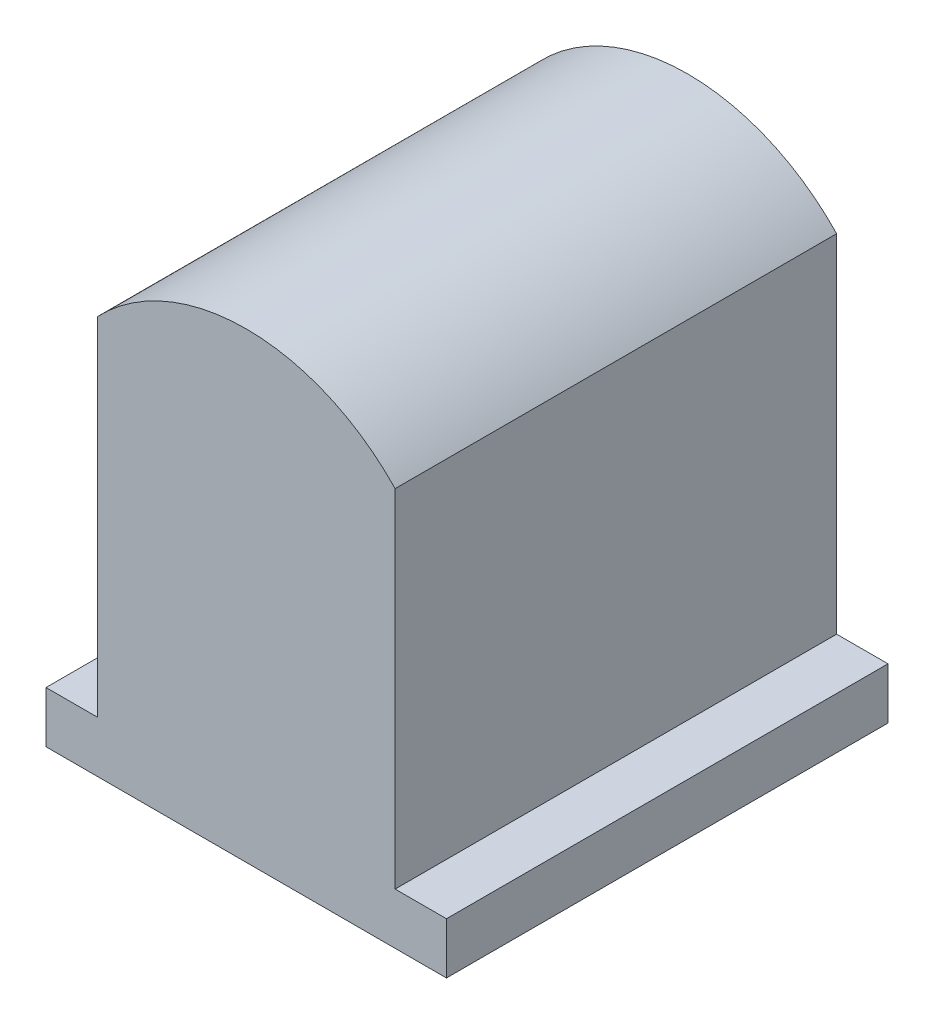
ISO-10303-21;
HEADER;
FILE_DESCRIPTION(('STEP AP214'),'2;1');
FILE_NAME('part.step','',(''),(''),'','','');
FILE_SCHEMA(('AUTOMOTIVE_DESIGN { 1 0 10303 214 1 1 1 1 }'));
ENDSEC;
DATA;
#1=APPLICATION_CONTEXT('core data for automotive mechanical design processes');
#2=APPLICATION_PROTOCOL_DEFINITION('international standard','automotive_design',2000,#1);
#3=PRODUCT_CONTEXT('',#1,'mechanical');
#4=PRODUCT('Part','Part','',(#3));
#5=PRODUCT_RELATED_PRODUCT_CATEGORY('part','',(#4));
#6=PRODUCT_DEFINITION_FORMATION('','',#4);
#7=PRODUCT_DEFINITION_CONTEXT('part definition',#1,'design');
#8=PRODUCT_DEFINITION('design','',#6,#7);
#9=PRODUCT_DEFINITION_SHAPE('','',#8);
#10=(LENGTH_UNIT() NAMED_UNIT(*) SI_UNIT(.MILLI.,.METRE.));
#11=(NAMED_UNIT(*) PLANE_ANGLE_UNIT() SI_UNIT($,.RADIAN.));
#12=(NAMED_UNIT(*) SI_UNIT($,.STERADIAN.) SOLID_ANGLE_UNIT());
#13=UNCERTAINTY_MEASURE_WITH_UNIT(LENGTH_MEASURE(1.E-05),#10,'distance_accuracy_value','');
#14=(GEOMETRIC_REPRESENTATION_CONTEXT(3) GLOBAL_UNCERTAINTY_ASSIGNED_CONTEXT((#13)) GLOBAL_UNIT_ASSIGNED_CONTEXT((#10,
#11,#12)) REPRESENTATION_CONTEXT('',''));
#15=CARTESIAN_POINT('',(0.,0.,0.));
#16=DIRECTION('',(0.,0.,1.));
#17=DIRECTION('',(1.,0.,0.));
#18=AXIS2_PLACEMENT_3D('',#15,#16,#17);
#19=CARTESIAN_POINT('',(0.,0.561251134302204,4.3));
#20=DIRECTION('',(0.,0.,-1.));
#21=DIRECTION('',(-1.,0.,0.));
#22=AXIS2_PLACEMENT_3D('',#19,#20,#21);
#23=CYLINDRICAL_SURFACE('',#22,2.);
#24=CARTESIAN_POINT('',(0.,0.561251134302204,0.));
#25=DIRECTION('',(0.,0.,1.));
#26=DIRECTION('',(-1.,0.,0.));
#27=AXIS2_PLACEMENT_3D('',#24,#25,#26);
#28=CIRCLE('',#27,2.);
#29=CARTESIAN_POINT('',(1.45,1.9387488656978,0.));
#30=VERTEX_POINT('',#29);
#31=CARTESIAN_POINT('',(-1.45,1.9387488656978,0.));
#32=VERTEX_POINT('',#31);
#33=EDGE_CURVE('E133',#30,#32,#28,.T.);
#34=ORIENTED_EDGE('',*,*,#33,.T.);
#35=DIRECTION('',(0.,0.,-1.));
#36=VECTOR('',#35,1.);
#37=CARTESIAN_POINT('',(-1.45,1.9387488656978,4.3));
#38=LINE('',#37,#36);
#39=CARTESIAN_POINT('',(-1.45,1.9387488656978,4.3));
#40=VERTEX_POINT('',#39);
#41=EDGE_CURVE('E11',#40,#32,#38,.T.);
#42=ORIENTED_EDGE('',*,*,#41,.F.);
#43=CARTESIAN_POINT('',(0.,0.561251134302204,4.3));
#44=DIRECTION('',(0.,0.,1.));
#45=DIRECTION('',(-1.,0.,0.));
#46=AXIS2_PLACEMENT_3D('',#43,#44,#45);
#47=CIRCLE('',#46,2.);
#48=CARTESIAN_POINT('',(1.45,1.9387488656978,4.3));
#49=VERTEX_POINT('',#48);
#50=EDGE_CURVE('E148',#49,#40,#47,.T.);
#51=ORIENTED_EDGE('',*,*,#50,.F.);
#52=DIRECTION('',(0.,0.,-1.));
#53=VECTOR('',#52,1.);
#54=CARTESIAN_POINT('',(1.45,1.9387488656978,4.3));
#55=LINE('',#54,#53);
#56=EDGE_CURVE('E129',#49,#30,#55,.T.);
#57=ORIENTED_EDGE('',*,*,#56,.T.);
#58=EDGE_LOOP('',(#34,#42,#51,#57));
#59=FACE_BOUND('',#58,.T.);
#60=ADVANCED_FACE('F37',(#59),#23,.T.);
#61=CARTESIAN_POINT('',(-1.45,-1.4387488656978,4.3));
#62=DIRECTION('',(1.,0.,0.));
#63=DIRECTION('',(0.,0.,-1.));
#64=AXIS2_PLACEMENT_3D('',#61,#62,#63);
#65=PLANE('',#64);
#66=DIRECTION('',(0.,-1.,0.));
#67=VECTOR('',#66,1.);
#68=CARTESIAN_POINT('',(-1.45,-1.4387488656978,0.));
#69=LINE('',#68,#67);
#70=CARTESIAN_POINT('',(-1.45,-1.4387488656978,0.));
#71=VERTEX_POINT('',#70);
#72=EDGE_CURVE('E136',#32,#71,#69,.T.);
#73=ORIENTED_EDGE('',*,*,#72,.T.);
#74=DIRECTION('',(0.,0.,-1.));
#75=VECTOR('',#74,1.);
#76=CARTESIAN_POINT('',(-1.45,-1.4387488656978,4.3));
#77=LINE('',#76,#75);
#78=CARTESIAN_POINT('',(-1.45,-1.4387488656978,4.3));
#79=VERTEX_POINT('',#78);
#80=EDGE_CURVE('E45',#79,#71,#77,.T.);
#81=ORIENTED_EDGE('',*,*,#80,.F.);
#82=DIRECTION('',(0.,-1.,0.));
#83=VECTOR('',#82,1.);
#84=CARTESIAN_POINT('',(-1.45,-1.4387488656978,4.3));
#85=LINE('',#84,#83);
#86=EDGE_CURVE('E96',#40,#79,#85,.T.);
#87=ORIENTED_EDGE('',*,*,#86,.F.);
#88=ORIENTED_EDGE('',*,*,#41,.T.);
#89=EDGE_LOOP('',(#73,#81,#87,#88));
#90=FACE_BOUND('',#89,.T.);
#91=ADVANCED_FACE('F182',(#90),#65,.F.);
#92=CARTESIAN_POINT('',(-1.45,-1.4387488656978,4.3));
#93=DIRECTION('',(0.,-1.,0.));
#94=DIRECTION('',(0.,0.,-1.));
#95=AXIS2_PLACEMENT_3D('',#92,#93,#94);
#96=PLANE('',#95);
#97=DIRECTION('',(-1.,0.,0.));
#98=VECTOR('',#97,1.);
#99=CARTESIAN_POINT('',(-1.45,-1.4387488656978,0.));
#100=LINE('',#99,#98);
#101=CARTESIAN_POINT('',(-1.95,-1.4387488656978,0.));
#102=VERTEX_POINT('',#101);
#103=EDGE_CURVE('E138',#71,#102,#100,.T.);
#104=ORIENTED_EDGE('',*,*,#103,.T.);
#105=DIRECTION('',(0.,0.,-1.));
#106=VECTOR('',#105,1.);
#107=CARTESIAN_POINT('',(-1.95,-1.4387488656978,4.3));
#108=LINE('',#107,#106);
#109=CARTESIAN_POINT('',(-1.95,-1.4387488656978,4.3));
#110=VERTEX_POINT('',#109);
#111=EDGE_CURVE('E155',#110,#102,#108,.T.);
#112=ORIENTED_EDGE('',*,*,#111,.F.);
#113=DIRECTION('',(-1.,0.,0.));
#114=VECTOR('',#113,1.);
#115=CARTESIAN_POINT('',(-1.45,-1.4387488656978,4.3));
#116=LINE('',#115,#114);
#117=EDGE_CURVE('E163',#79,#110,#116,.T.);
#118=ORIENTED_EDGE('',*,*,#117,.F.);
#119=ORIENTED_EDGE('',*,*,#80,.T.);
#120=EDGE_LOOP('',(#104,#112,#118,#119));
#121=FACE_BOUND('',#120,.T.);
#122=ADVANCED_FACE('F161',(#121),#96,.F.);
#123=CARTESIAN_POINT('',(-1.95,-1.4387488656978,4.3));
#124=DIRECTION('',(1.,0.,0.));
#125=DIRECTION('',(0.,0.,-1.));
#126=AXIS2_PLACEMENT_3D('',#123,#124,#125);
#127=PLANE('',#126);
#128=DIRECTION('',(0.,-1.,0.));
#129=VECTOR('',#128,1.);
#130=CARTESIAN_POINT('',(-1.95,-1.4387488656978,0.));
#131=LINE('',#130,#129);
#132=CARTESIAN_POINT('',(-1.95,-1.9387488656978,0.));
#133=VERTEX_POINT('',#132);
#134=EDGE_CURVE('E140',#102,#133,#131,.T.);
#135=ORIENTED_EDGE('',*,*,#134,.T.);
#136=DIRECTION('',(0.,0.,-1.));
#137=VECTOR('',#136,1.);
#138=CARTESIAN_POINT('',(-1.95,-1.9387488656978,4.3));
#139=LINE('',#138,#137);
#140=CARTESIAN_POINT('',(-1.95,-1.9387488656978,4.3));
#141=VERTEX_POINT('',#140);
#142=EDGE_CURVE('E152',#141,#133,#139,.T.);
#143=ORIENTED_EDGE('',*,*,#142,.F.);
#144=DIRECTION('',(0.,-1.,0.));
#145=VECTOR('',#144,1.);
#146=CARTESIAN_POINT('',(-1.95,-1.4387488656978,4.3));
#147=LINE('',#146,#145);
#148=EDGE_CURVE('E174',#110,#141,#147,.T.);
#149=ORIENTED_EDGE('',*,*,#148,.F.);
#150=ORIENTED_EDGE('',*,*,#111,.T.);
#151=EDGE_LOOP('',(#135,#143,#149,#150));
#152=FACE_BOUND('',#151,.T.);
#153=ADVANCED_FACE('F170',(#152),#127,.F.);
#154=CARTESIAN_POINT('',(1.95,-1.9387488656978,4.3));
#155=DIRECTION('',(0.,1.,0.));
#156=DIRECTION('',(0.,0.,1.));
#157=AXIS2_PLACEMENT_3D('',#154,#155,#156);
#158=PLANE('',#157);
#159=DIRECTION('',(1.,0.,0.));
#160=VECTOR('',#159,1.);
#161=CARTESIAN_POINT('',(1.95,-1.9387488656978,0.));
#162=LINE('',#161,#160);
#163=CARTESIAN_POINT('',(1.95,-1.9387488656978,0.));
#164=VERTEX_POINT('',#163);
#165=EDGE_CURVE('E143',#133,#164,#162,.T.);
#166=ORIENTED_EDGE('',*,*,#165,.T.);
#167=DIRECTION('',(0.,0.,-1.));
#168=VECTOR('',#167,1.);
#169=CARTESIAN_POINT('',(1.95,-1.9387488656978,4.3));
#170=LINE('',#169,#168);
#171=CARTESIAN_POINT('',(1.95,-1.9387488656978,4.3));
#172=VERTEX_POINT('',#171);
#173=EDGE_CURVE('E124',#172,#164,#170,.T.);
#174=ORIENTED_EDGE('',*,*,#173,.F.);
#175=DIRECTION('',(1.,0.,0.));
#176=VECTOR('',#175,1.);
#177=CARTESIAN_POINT('',(-1.95,-1.9387488656978,4.3));
#178=LINE('',#177,#176);
#179=EDGE_CURVE('E115',#141,#172,#178,.T.);
#180=ORIENTED_EDGE('',*,*,#179,.F.);
#181=ORIENTED_EDGE('',*,*,#142,.T.);
#182=EDGE_LOOP('',(#166,#174,#180,#181));
#183=FACE_BOUND('',#182,.T.);
#184=ADVANCED_FACE('F173',(#183),#158,.F.);
#185=CARTESIAN_POINT('',(1.95,-1.43874886569779,4.3));
#186=DIRECTION('',(-1.,0.,0.));
#187=DIRECTION('',(0.,0.,1.));
#188=AXIS2_PLACEMENT_3D('',#185,#186,#187);
#189=PLANE('',#188);
#190=DIRECTION('',(0.,1.,0.));
#191=VECTOR('',#190,1.);
#192=CARTESIAN_POINT('',(1.95,-1.43874886569779,0.));
#193=LINE('',#192,#191);
#194=CARTESIAN_POINT('',(1.95,-1.43874886569779,0.));
#195=VERTEX_POINT('',#194);
#196=EDGE_CURVE('E123',#164,#195,#193,.T.);
#197=ORIENTED_EDGE('',*,*,#196,.T.);
#198=DIRECTION('',(0.,0.,-1.));
#199=VECTOR('',#198,1.);
#200=CARTESIAN_POINT('',(1.95,-1.43874886569779,4.3));
#201=LINE('',#200,#199);
#202=CARTESIAN_POINT('',(1.95,-1.43874886569779,4.3));
#203=VERTEX_POINT('',#202);
#204=EDGE_CURVE('E120',#203,#195,#201,.T.);
#205=ORIENTED_EDGE('',*,*,#204,.F.);
#206=DIRECTION('',(0.,1.,0.));
#207=VECTOR('',#206,1.);
#208=CARTESIAN_POINT('',(1.95,-1.43874886569779,4.3));
#209=LINE('',#208,#207);
#210=EDGE_CURVE('E109',#172,#203,#209,.T.);
#211=ORIENTED_EDGE('',*,*,#210,.F.);
#212=ORIENTED_EDGE('',*,*,#173,.T.);
#213=EDGE_LOOP('',(#197,#205,#211,#212));
#214=FACE_BOUND('',#213,.T.);
#215=ADVANCED_FACE('F121',(#214),#189,.F.);
#216=CARTESIAN_POINT('',(1.45,-1.4387488656978,4.3));
#217=DIRECTION('',(0.,-1.,0.));
#218=DIRECTION('',(1.,0.,0.));
#219=AXIS2_PLACEMENT_3D('',#216,#217,#218);
#220=PLANE('',#219);
#221=DIRECTION('',(-1.,0.,0.));
#222=VECTOR('',#221,1.);
#223=CARTESIAN_POINT('',(1.45,-1.4387488656978,0.));
#224=LINE('',#223,#222);
#225=CARTESIAN_POINT('',(1.45,-1.4387488656978,0.));
#226=VERTEX_POINT('',#225);
#227=EDGE_CURVE('E82',#195,#226,#224,.T.);
#228=ORIENTED_EDGE('',*,*,#227,.T.);
#229=DIRECTION('',(0.,0.,-1.));
#230=VECTOR('',#229,1.);
#231=CARTESIAN_POINT('',(1.45,-1.4387488656978,4.3));
#232=LINE('',#231,#230);
#233=CARTESIAN_POINT('',(1.45,-1.4387488656978,4.3));
#234=VERTEX_POINT('',#233);
#235=EDGE_CURVE('E125',#234,#226,#232,.T.);
#236=ORIENTED_EDGE('',*,*,#235,.F.);
#237=DIRECTION('',(-1.,0.,0.));
#238=VECTOR('',#237,1.);
#239=CARTESIAN_POINT('',(1.45,-1.4387488656978,4.3));
#240=LINE('',#239,#238);
#241=EDGE_CURVE('E113',#203,#234,#240,.T.);
#242=ORIENTED_EDGE('',*,*,#241,.F.);
#243=ORIENTED_EDGE('',*,*,#204,.T.);
#244=EDGE_LOOP('',(#228,#236,#242,#243));
#245=FACE_BOUND('',#244,.T.);
#246=ADVANCED_FACE('F127',(#245),#220,.F.);
#247=CARTESIAN_POINT('',(1.45,-1.4387488656978,4.3));
#248=DIRECTION('',(-1.,0.,0.));
#249=DIRECTION('',(0.,0.,1.));
#250=AXIS2_PLACEMENT_3D('',#247,#248,#249);
#251=PLANE('',#250);
#252=DIRECTION('',(0.,1.,0.));
#253=VECTOR('',#252,1.);
#254=CARTESIAN_POINT('',(1.45,-1.4387488656978,0.));
#255=LINE('',#254,#253);
#256=EDGE_CURVE('E88',#226,#30,#255,.T.);
#257=ORIENTED_EDGE('',*,*,#256,.T.);
#258=ORIENTED_EDGE('',*,*,#56,.F.);
#259=DIRECTION('',(0.,1.,0.));
#260=VECTOR('',#259,1.);
#261=CARTESIAN_POINT('',(1.45,-1.4387488656978,4.3));
#262=LINE('',#261,#260);
#263=EDGE_CURVE('E53',#234,#49,#262,.T.);
#264=ORIENTED_EDGE('',*,*,#263,.F.);
#265=ORIENTED_EDGE('',*,*,#235,.T.);
#266=EDGE_LOOP('',(#257,#258,#264,#265));
#267=FACE_BOUND('',#266,.T.);
#268=ADVANCED_FACE('F198',(#267),#251,.F.);
#269=CARTESIAN_POINT('',(0.,0.561251134302204,4.3));
#270=DIRECTION('',(0.,0.,-1.));
#271=DIRECTION('',(-1.,0.,0.));
#272=AXIS2_PLACEMENT_3D('',#269,#270,#271);
#273=PLANE('',#272);
#274=ORIENTED_EDGE('',*,*,#50,.T.);
#275=ORIENTED_EDGE('',*,*,#86,.T.);
#276=ORIENTED_EDGE('',*,*,#117,.T.);
#277=ORIENTED_EDGE('',*,*,#148,.T.);
#278=ORIENTED_EDGE('',*,*,#179,.T.);
#279=ORIENTED_EDGE('',*,*,#210,.T.);
#280=ORIENTED_EDGE('',*,*,#241,.T.);
#281=ORIENTED_EDGE('',*,*,#263,.T.);
#282=EDGE_LOOP('',(#274,#275,#276,#277,#278,#279,#280,#281));
#283=FACE_BOUND('',#282,.T.);
#284=ADVANCED_FACE('F111',(#283),#273,.F.);
#285=CARTESIAN_POINT('',(0.,0.561251134302204,0.));
#286=DIRECTION('',(0.,0.,-1.));
#287=DIRECTION('',(-1.,0.,0.));
#288=AXIS2_PLACEMENT_3D('',#285,#286,#287);
#289=PLANE('',#288);
#290=ORIENTED_EDGE('',*,*,#33,.F.);
#291=ORIENTED_EDGE('',*,*,#256,.F.);
#292=ORIENTED_EDGE('',*,*,#227,.F.);
#293=ORIENTED_EDGE('',*,*,#196,.F.);
#294=ORIENTED_EDGE('',*,*,#165,.F.);
#295=ORIENTED_EDGE('',*,*,#134,.F.);
#296=ORIENTED_EDGE('',*,*,#103,.F.);
#297=ORIENTED_EDGE('',*,*,#72,.F.);
#298=EDGE_LOOP('',(#290,#291,#292,#293,#294,#295,#296,#297));
#299=FACE_BOUND('',#298,.T.);
#300=ADVANCED_FACE('F167',(#299),#289,.T.);
#301=CLOSED_SHELL('',(#60,#91,#122,#153,#184,#215,#246,#268,#284,#300));
#302=MANIFOLD_SOLID_BREP('B2',#301);
#303=ADVANCED_BREP_SHAPE_REPRESENTATION('',(#18,#302),#14);
#304=SHAPE_DEFINITION_REPRESENTATION(#9,#303);
ENDSEC;
END-ISO-10303-21;
